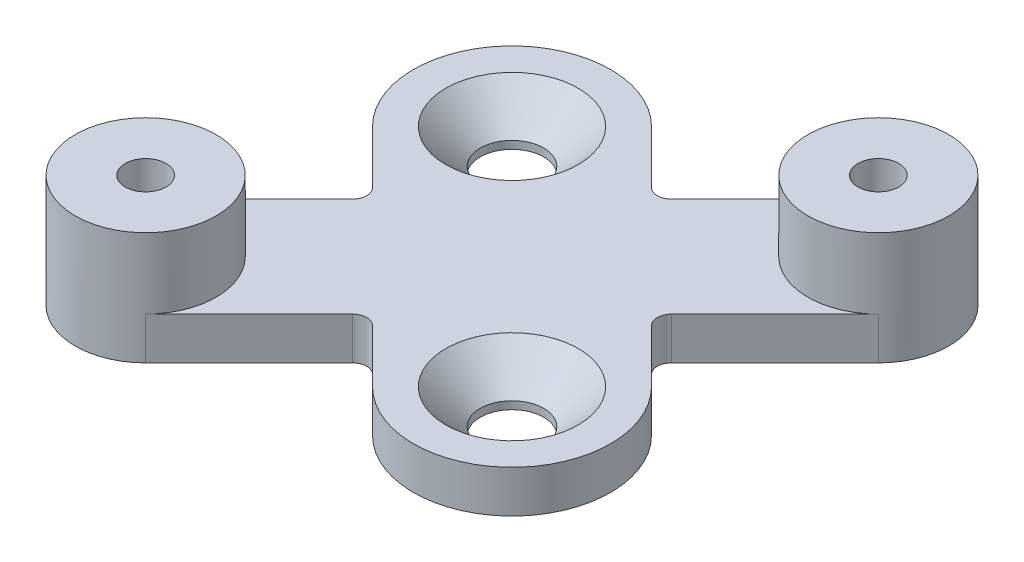
ISO-10303-21;
HEADER;
FILE_DESCRIPTION(('STEP AP214'),'2;1');
FILE_NAME('part.step','',(''),(''),'','','');
FILE_SCHEMA(('AUTOMOTIVE_DESIGN { 1 0 10303 214 1 1 1 1 }'));
ENDSEC;
DATA;
#1=APPLICATION_CONTEXT('core data for automotive mechanical design processes');
#2=APPLICATION_PROTOCOL_DEFINITION('international standard','automotive_design',2000,#1);
#3=PRODUCT_CONTEXT('',#1,'mechanical');
#4=PRODUCT('Part','Part','',(#3));
#5=PRODUCT_RELATED_PRODUCT_CATEGORY('part','',(#4));
#6=PRODUCT_DEFINITION_FORMATION('','',#4);
#7=PRODUCT_DEFINITION_CONTEXT('part definition',#1,'design');
#8=PRODUCT_DEFINITION('design','',#6,#7);
#9=PRODUCT_DEFINITION_SHAPE('','',#8);
#10=(LENGTH_UNIT() NAMED_UNIT(*) SI_UNIT(.MILLI.,.METRE.));
#11=(NAMED_UNIT(*) PLANE_ANGLE_UNIT() SI_UNIT($,.RADIAN.));
#12=(NAMED_UNIT(*) SI_UNIT($,.STERADIAN.) SOLID_ANGLE_UNIT());
#13=UNCERTAINTY_MEASURE_WITH_UNIT(LENGTH_MEASURE(1.E-05),#10,'distance_accuracy_value','');
#14=(GEOMETRIC_REPRESENTATION_CONTEXT(3) GLOBAL_UNCERTAINTY_ASSIGNED_CONTEXT((#13)) GLOBAL_UNIT_ASSIGNED_CONTEXT((#10,
#11,#12)) REPRESENTATION_CONTEXT('',''));
#15=CARTESIAN_POINT('',(0.,0.,0.));
#16=DIRECTION('',(0.,0.,1.));
#17=DIRECTION('',(1.,0.,0.));
#18=AXIS2_PLACEMENT_3D('',#15,#16,#17);
#19=CARTESIAN_POINT('',(13.0000000000001,3.,-13.));
#20=DIRECTION('',(0.,1.,0.));
#21=DIRECTION('',(0.,0.,1.));
#22=AXIS2_PLACEMENT_3D('',#19,#20,#21);
#23=PLANE('',#22);
#24=CARTESIAN_POINT('',(8.00000000000002,3.,8.00000000000003));
#25=DIRECTION('',(0.,1.,0.));
#26=DIRECTION('',(0.,0.,1.));
#27=AXIS2_PLACEMENT_3D('',#24,#25,#26);
#28=CIRCLE('',#27,4.7);
#29=CARTESIAN_POINT('',(8.00000000000002,3.,12.7));
#30=VERTEX_POINT('',#29);
#31=EDGE_CURVE('E242',#30,#30,#28,.T.);
#32=ORIENTED_EDGE('',*,*,#31,.F.);
#33=EDGE_LOOP('',(#32));
#34=FACE_BOUND('',#33,.T.);
#35=CARTESIAN_POINT('',(-7.99999999999998,3.,-8.00000000000003));
#36=DIRECTION('',(0.,1.,0.));
#37=DIRECTION('',(0.,0.,1.));
#38=AXIS2_PLACEMENT_3D('',#35,#36,#37);
#39=CIRCLE('',#38,4.7);
#40=CARTESIAN_POINT('',(-7.99999999999998,3.,-3.30000000000003));
#41=VERTEX_POINT('',#40);
#42=EDGE_CURVE('E233',#41,#41,#39,.T.);
#43=ORIENTED_EDGE('',*,*,#42,.F.);
#44=EDGE_LOOP('',(#43));
#45=FACE_BOUND('',#44,.T.);
#46=DIRECTION('',(0.707106781186551,0.,-0.707106781186544));
#47=VECTOR('',#46,1.);
#48=CARTESIAN_POINT('',(16.5355339059328,3.,-9.46446609406724));
#49=LINE('',#48,#47);
#50=CARTESIAN_POINT('',(9.19238815542514,3.,-2.12132034355963));
#51=VERTEX_POINT('',#50);
#52=CARTESIAN_POINT('',(16.5355339059328,3.,-9.46446609406724));
#53=VERTEX_POINT('',#52);
#54=EDGE_CURVE('E159',#51,#53,#49,.T.);
#55=ORIENTED_EDGE('',*,*,#54,.T.);
#56=CARTESIAN_POINT('',(13.0000000000001,3.,-13.));
#57=DIRECTION('',(0.,1.,0.));
#58=DIRECTION('',(0.,0.,1.));
#59=AXIS2_PLACEMENT_3D('',#56,#57,#58);
#60=CIRCLE('',#59,5.);
#61=CARTESIAN_POINT('',(9.46446609406734,3.,-16.5355339059327));
#62=VERTEX_POINT('',#61);
#63=EDGE_CURVE('E11',#53,#62,#60,.F.);
#64=ORIENTED_EDGE('',*,*,#63,.T.);
#65=DIRECTION('',(-0.707106781186551,0.,0.707106781186544));
#66=VECTOR('',#65,1.);
#67=CARTESIAN_POINT('',(1.41421356237312,3.,-8.48528137423857));
#68=LINE('',#67,#66);
#69=CARTESIAN_POINT('',(2.12132034355966,3.,-9.19238815542512));
#70=VERTEX_POINT('',#69);
#71=EDGE_CURVE('E252',#62,#70,#68,.T.);
#72=ORIENTED_EDGE('',*,*,#71,.T.);
#73=CARTESIAN_POINT('',(1.41421356237312,3.,-9.89949493661167));
#74=DIRECTION('',(0.,1.,0.));
#75=DIRECTION('',(0.,0.,1.));
#76=AXIS2_PLACEMENT_3D('',#73,#74,#75);
#77=CIRCLE('',#76,1.);
#78=CARTESIAN_POINT('',(0.707106781186574,3.,-9.19238815542512));
#79=VERTEX_POINT('',#78);
#80=EDGE_CURVE('E214',#70,#79,#77,.F.);
#81=ORIENTED_EDGE('',*,*,#80,.T.);
#82=DIRECTION('',(-0.707106781186546,0.,-0.707106781186549));
#83=VECTOR('',#82,1.);
#84=CARTESIAN_POINT('',(-3.05025253169415,3.,-12.9497474683058));
#85=LINE('',#84,#83);
#86=CARTESIAN_POINT('',(-3.05025253169415,3.,-12.9497474683058));
#87=VERTEX_POINT('',#86);
#88=EDGE_CURVE('E254',#79,#87,#85,.T.);
#89=ORIENTED_EDGE('',*,*,#88,.T.);
#90=CARTESIAN_POINT('',(-7.99999999999998,3.,-8.00000000000003));
#91=DIRECTION('',(0.,1.,0.));
#92=DIRECTION('',(0.,0.,1.));
#93=AXIS2_PLACEMENT_3D('',#90,#91,#92);
#94=CIRCLE('',#93,7.);
#95=CARTESIAN_POINT('',(-12.9497474683058,3.,-3.0502525316942));
#96=VERTEX_POINT('',#95);
#97=EDGE_CURVE('E256',#87,#96,#94,.T.);
#98=ORIENTED_EDGE('',*,*,#97,.T.);
#99=DIRECTION('',(0.707106781186546,0.,0.707106781186549));
#100=VECTOR('',#99,1.);
#101=CARTESIAN_POINT('',(-8.48528137423856,3.,1.41421356237307));
#102=LINE('',#101,#100);
#103=CARTESIAN_POINT('',(-9.19238815542511,3.,0.707106781186523));
#104=VERTEX_POINT('',#103);
#105=EDGE_CURVE('E258',#96,#104,#102,.T.);
#106=ORIENTED_EDGE('',*,*,#105,.T.);
#107=CARTESIAN_POINT('',(-9.89949493661166,3.,1.41421356237307));
#108=DIRECTION('',(0.,1.,0.));
#109=DIRECTION('',(0.,0.,1.));
#110=AXIS2_PLACEMENT_3D('',#107,#108,#109);
#111=CIRCLE('',#110,1.);
#112=CARTESIAN_POINT('',(-9.19238815542511,3.,2.12132034355962));
#113=VERTEX_POINT('',#112);
#114=EDGE_CURVE('E210',#104,#113,#111,.F.);
#115=ORIENTED_EDGE('',*,*,#114,.T.);
#116=DIRECTION('',(-0.707106781186549,0.,0.707106781186546));
#117=VECTOR('',#116,1.);
#118=CARTESIAN_POINT('',(-16.5355339059328,3.,9.46446609406725));
#119=LINE('',#118,#117);
#120=CARTESIAN_POINT('',(-16.5355339059328,3.,9.46446609406726));
#121=VERTEX_POINT('',#120);
#122=EDGE_CURVE('E261',#113,#121,#119,.T.);
#123=ORIENTED_EDGE('',*,*,#122,.T.);
#124=CARTESIAN_POINT('',(-13.,3.,13.));
#125=DIRECTION('',(0.,1.,0.));
#126=DIRECTION('',(0.,0.,1.));
#127=AXIS2_PLACEMENT_3D('',#124,#125,#126);
#128=CIRCLE('',#127,5.);
#129=CARTESIAN_POINT('',(-9.46446609406729,3.,16.5355339059327));
#130=VERTEX_POINT('',#129);
#131=EDGE_CURVE('E226',#130,#121,#128,.T.);
#132=ORIENTED_EDGE('',*,*,#131,.F.);
#133=DIRECTION('',(0.707106781186549,0.,-0.707106781186546));
#134=VECTOR('',#133,1.);
#135=CARTESIAN_POINT('',(-1.4142135623731,3.,8.48528137423856));
#136=LINE('',#135,#134);
#137=CARTESIAN_POINT('',(-2.12132034355964,3.,9.19238815542511));
#138=VERTEX_POINT('',#137);
#139=EDGE_CURVE('E223',#130,#138,#136,.T.);
#140=ORIENTED_EDGE('',*,*,#139,.T.);
#141=CARTESIAN_POINT('',(-1.4142135623731,3.,9.89949493661166));
#142=DIRECTION('',(0.,1.,0.));
#143=DIRECTION('',(0.,0.,1.));
#144=AXIS2_PLACEMENT_3D('',#141,#142,#143);
#145=CIRCLE('',#144,1.);
#146=CARTESIAN_POINT('',(-0.707106781186549,3.,9.19238815542511));
#147=VERTEX_POINT('',#146);
#148=EDGE_CURVE('E41',#138,#147,#145,.F.);
#149=ORIENTED_EDGE('',*,*,#148,.T.);
#150=DIRECTION('',(0.707106781186546,0.,0.707106781186549));
#151=VECTOR('',#150,1.);
#152=CARTESIAN_POINT('',(3.05025253169417,3.,12.9497474683058));
#153=LINE('',#152,#151);
#154=CARTESIAN_POINT('',(3.05025253169417,3.,12.9497474683058));
#155=VERTEX_POINT('',#154);
#156=EDGE_CURVE('E262',#147,#155,#153,.T.);
#157=ORIENTED_EDGE('',*,*,#156,.T.);
#158=CARTESIAN_POINT('',(8.00000000000002,3.,8.00000000000003));
#159=DIRECTION('',(0.,1.,0.));
#160=DIRECTION('',(0.,0.,1.));
#161=AXIS2_PLACEMENT_3D('',#158,#159,#160);
#162=CIRCLE('',#161,7.);
#163=CARTESIAN_POINT('',(12.9497474683059,3.,3.05025253169421));
#164=VERTEX_POINT('',#163);
#165=EDGE_CURVE('E264',#155,#164,#162,.T.);
#166=ORIENTED_EDGE('',*,*,#165,.T.);
#167=DIRECTION('',(-0.707106781186546,0.,-0.707106781186549));
#168=VECTOR('',#167,1.);
#169=CARTESIAN_POINT('',(8.48528137423858,3.,-1.41421356237309));
#170=LINE('',#169,#168);
#171=CARTESIAN_POINT('',(9.19238815542513,3.,-0.707106781186536));
#172=VERTEX_POINT('',#171);
#173=EDGE_CURVE('E166',#164,#172,#170,.T.);
#174=ORIENTED_EDGE('',*,*,#173,.T.);
#175=CARTESIAN_POINT('',(9.89949493661168,3.,-1.41421356237308));
#176=DIRECTION('',(0.,1.,0.));
#177=DIRECTION('',(0.,0.,1.));
#178=AXIS2_PLACEMENT_3D('',#175,#176,#177);
#179=CIRCLE('',#178,1.);
#180=EDGE_CURVE('E162',#172,#51,#179,.F.);
#181=ORIENTED_EDGE('',*,*,#180,.T.);
#182=EDGE_LOOP('',(#55,#64,#72,#81,#89,#98,#106,#115,#123,#132,#140,#149,#157,#166,#174,#181));
#183=FACE_BOUND('',#182,.T.);
#184=ADVANCED_FACE('F33',(#34,#45,#183),#23,.T.);
#185=CARTESIAN_POINT('',(13.0000000000001,3.,-13.));
#186=DIRECTION('',(0.,-1.,0.));
#187=DIRECTION('',(0.,0.,-1.));
#188=AXIS2_PLACEMENT_3D('',#185,#186,#187);
#189=CYLINDRICAL_SURFACE('',#188,5.);
#190=CARTESIAN_POINT('',(13.0000000000001,0.,-13.));
#191=DIRECTION('',(0.,1.,0.));
#192=DIRECTION('',(0.,0.,1.));
#193=AXIS2_PLACEMENT_3D('',#190,#191,#192);
#194=CIRCLE('',#193,5.);
#195=CARTESIAN_POINT('',(16.5355339059328,0.,-9.46446609406724));
#196=VERTEX_POINT('',#195);
#197=CARTESIAN_POINT('',(9.46446609406734,0.,-16.5355339059327));
#198=VERTEX_POINT('',#197);
#199=EDGE_CURVE('E251',#196,#198,#194,.T.);
#200=ORIENTED_EDGE('',*,*,#199,.T.);
#201=DIRECTION('',(0.,-1.,0.));
#202=VECTOR('',#201,1.);
#203=CARTESIAN_POINT('',(9.46446609406734,3.,-16.5355339059327));
#204=LINE('',#203,#202);
#205=EDGE_CURVE('E154',#62,#198,#204,.T.);
#206=ORIENTED_EDGE('',*,*,#205,.F.);
#207=ORIENTED_EDGE('',*,*,#63,.F.);
#208=DIRECTION('',(0.,-1.,0.));
#209=VECTOR('',#208,1.);
#210=CARTESIAN_POINT('',(16.5355339059328,3.,-9.46446609406724));
#211=LINE('',#210,#209);
#212=EDGE_CURVE('E151',#53,#196,#211,.T.);
#213=ORIENTED_EDGE('',*,*,#212,.T.);
#214=EDGE_LOOP('',(#200,#206,#207,#213));
#215=FACE_BOUND('',#214,.T.);
#216=CARTESIAN_POINT('',(13.0000000000001,8.,-13.));
#217=DIRECTION('',(0.,1.,0.));
#218=DIRECTION('',(0.,0.,1.));
#219=AXIS2_PLACEMENT_3D('',#216,#217,#218);
#220=CIRCLE('',#219,5.);
#221=CARTESIAN_POINT('',(13.0000000000001,8.,-7.99999999999999));
#222=VERTEX_POINT('',#221);
#223=EDGE_CURVE('E231',#222,#222,#220,.T.);
#224=ORIENTED_EDGE('',*,*,#223,.F.);
#225=EDGE_LOOP('',(#224));
#226=FACE_BOUND('',#225,.T.);
#227=ADVANCED_FACE('F148',(#215,#226),#189,.T.);
#228=CARTESIAN_POINT('',(1.41421356237312,3.,-8.48528137423857));
#229=DIRECTION('',(0.707106781186544,0.,0.70710678118655));
#230=DIRECTION('',(0.707106781186551,0.,-0.707106781186545));
#231=AXIS2_PLACEMENT_3D('',#228,#229,#230);
#232=PLANE('',#231);
#233=DIRECTION('',(-0.707106781186551,0.,0.707106781186544));
#234=VECTOR('',#233,1.);
#235=CARTESIAN_POINT('',(1.41421356237312,0.,-8.48528137423857));
#236=LINE('',#235,#234);
#237=CARTESIAN_POINT('',(2.12132034355966,0.,-9.19238815542512));
#238=VERTEX_POINT('',#237);
#239=EDGE_CURVE('E268',#198,#238,#236,.T.);
#240=ORIENTED_EDGE('',*,*,#239,.T.);
#241=DIRECTION('',(0.,-1.,0.));
#242=VECTOR('',#241,1.);
#243=CARTESIAN_POINT('',(2.12132034355966,3.,-9.19238815542512));
#244=LINE('',#243,#242);
#245=EDGE_CURVE('E198',#238,#70,#244,.F.);
#246=ORIENTED_EDGE('',*,*,#245,.T.);
#247=ORIENTED_EDGE('',*,*,#71,.F.);
#248=ORIENTED_EDGE('',*,*,#205,.T.);
#249=EDGE_LOOP('',(#240,#246,#247,#248));
#250=FACE_BOUND('',#249,.T.);
#251=ADVANCED_FACE('F302',(#250),#232,.F.);
#252=CARTESIAN_POINT('',(-3.05025253169415,3.,-12.9497474683058));
#253=DIRECTION('',(-0.707106781186549,0.,0.707106781186546));
#254=DIRECTION('',(0.707106781186546,0.,0.707106781186549));
#255=AXIS2_PLACEMENT_3D('',#252,#253,#254);
#256=PLANE('',#255);
#257=ORIENTED_EDGE('',*,*,#88,.F.);
#258=DIRECTION('',(0.,-1.,0.));
#259=VECTOR('',#258,1.);
#260=CARTESIAN_POINT('',(0.707106781186573,0.,-9.19238815542512));
#261=LINE('',#260,#259);
#262=CARTESIAN_POINT('',(0.707106781186574,0.,-9.19238815542512));
#263=VERTEX_POINT('',#262);
#264=EDGE_CURVE('E195',#79,#263,#261,.T.);
#265=ORIENTED_EDGE('',*,*,#264,.T.);
#266=DIRECTION('',(-0.707106781186546,0.,-0.707106781186549));
#267=VECTOR('',#266,1.);
#268=CARTESIAN_POINT('',(-3.05025253169415,0.,-12.9497474683058));
#269=LINE('',#268,#267);
#270=CARTESIAN_POINT('',(-3.05025253169415,0.,-12.9497474683058));
#271=VERTEX_POINT('',#270);
#272=EDGE_CURVE('E271',#263,#271,#269,.T.);
#273=ORIENTED_EDGE('',*,*,#272,.T.);
#274=DIRECTION('',(0.,-1.,0.));
#275=VECTOR('',#274,1.);
#276=CARTESIAN_POINT('',(-3.05025253169415,3.,-12.9497474683058));
#277=LINE('',#276,#275);
#278=EDGE_CURVE('E185',#87,#271,#277,.T.);
#279=ORIENTED_EDGE('',*,*,#278,.F.);
#280=EDGE_LOOP('',(#257,#265,#273,#279));
#281=FACE_BOUND('',#280,.T.);
#282=ADVANCED_FACE('F309',(#281),#256,.F.);
#283=CARTESIAN_POINT('',(-7.99999999999998,3.,-8.00000000000003));
#284=DIRECTION('',(0.,-1.,0.));
#285=DIRECTION('',(0.,0.,-1.));
#286=AXIS2_PLACEMENT_3D('',#283,#284,#285);
#287=CYLINDRICAL_SURFACE('',#286,7.);
#288=CARTESIAN_POINT('',(-7.99999999999998,0.,-8.00000000000003));
#289=DIRECTION('',(0.,1.,0.));
#290=DIRECTION('',(0.,0.,1.));
#291=AXIS2_PLACEMENT_3D('',#288,#289,#290);
#292=CIRCLE('',#291,7.);
#293=CARTESIAN_POINT('',(-12.9497474683058,0.,-3.0502525316942));
#294=VERTEX_POINT('',#293);
#295=EDGE_CURVE('E273',#271,#294,#292,.T.);
#296=ORIENTED_EDGE('',*,*,#295,.T.);
#297=DIRECTION('',(0.,-1.,0.));
#298=VECTOR('',#297,1.);
#299=CARTESIAN_POINT('',(-12.9497474683058,3.,-3.0502525316942));
#300=LINE('',#299,#298);
#301=EDGE_CURVE('E182',#96,#294,#300,.T.);
#302=ORIENTED_EDGE('',*,*,#301,.F.);
#303=ORIENTED_EDGE('',*,*,#97,.F.);
#304=ORIENTED_EDGE('',*,*,#278,.T.);
#305=EDGE_LOOP('',(#296,#302,#303,#304));
#306=FACE_BOUND('',#305,.T.);
#307=ADVANCED_FACE('F315',(#306),#287,.T.);
#308=CARTESIAN_POINT('',(-8.48528137423856,3.,1.41421356237307));
#309=DIRECTION('',(0.707106781186549,0.,-0.707106781186546));
#310=DIRECTION('',(-0.707106781186546,0.,-0.707106781186549));
#311=AXIS2_PLACEMENT_3D('',#308,#309,#310);
#312=PLANE('',#311);
#313=DIRECTION('',(0.707106781186546,0.,0.707106781186549));
#314=VECTOR('',#313,1.);
#315=CARTESIAN_POINT('',(-8.48528137423856,0.,1.41421356237307));
#316=LINE('',#315,#314);
#317=CARTESIAN_POINT('',(-9.19238815542511,0.,0.707106781186523));
#318=VERTEX_POINT('',#317);
#319=EDGE_CURVE('E275',#294,#318,#316,.T.);
#320=ORIENTED_EDGE('',*,*,#319,.T.);
#321=DIRECTION('',(0.,-1.,0.));
#322=VECTOR('',#321,1.);
#323=CARTESIAN_POINT('',(-9.19238815542511,3.,0.707106781186523));
#324=LINE('',#323,#322);
#325=EDGE_CURVE('E193',#318,#104,#324,.F.);
#326=ORIENTED_EDGE('',*,*,#325,.T.);
#327=ORIENTED_EDGE('',*,*,#105,.F.);
#328=ORIENTED_EDGE('',*,*,#301,.T.);
#329=EDGE_LOOP('',(#320,#326,#327,#328));
#330=FACE_BOUND('',#329,.T.);
#331=ADVANCED_FACE('F319',(#330),#312,.F.);
#332=CARTESIAN_POINT('',(-16.5355339059328,3.,9.46446609406725));
#333=DIRECTION('',(0.707106781186546,0.,0.707106781186548));
#334=DIRECTION('',(0.707106781186549,0.,-0.707106781186546));
#335=AXIS2_PLACEMENT_3D('',#332,#333,#334);
#336=PLANE('',#335);
#337=ORIENTED_EDGE('',*,*,#122,.F.);
#338=DIRECTION('',(0.,-1.,0.));
#339=VECTOR('',#338,1.);
#340=CARTESIAN_POINT('',(-9.19238815542511,0.,2.12132034355962));
#341=LINE('',#340,#339);
#342=CARTESIAN_POINT('',(-9.19238815542511,0.,2.12132034355962));
#343=VERTEX_POINT('',#342);
#344=EDGE_CURVE('E190',#113,#343,#341,.T.);
#345=ORIENTED_EDGE('',*,*,#344,.T.);
#346=DIRECTION('',(-0.707106781186549,0.,0.707106781186546));
#347=VECTOR('',#346,1.);
#348=CARTESIAN_POINT('',(-16.5355339059328,0.,9.46446609406725));
#349=LINE('',#348,#347);
#350=CARTESIAN_POINT('',(-16.5355339059328,0.,9.46446609406726));
#351=VERTEX_POINT('',#350);
#352=EDGE_CURVE('E278',#343,#351,#349,.T.);
#353=ORIENTED_EDGE('',*,*,#352,.T.);
#354=DIRECTION('',(0.,-1.,0.));
#355=VECTOR('',#354,1.);
#356=CARTESIAN_POINT('',(-16.5355339059328,3.,9.46446609406726));
#357=LINE('',#356,#355);
#358=EDGE_CURVE('E186',#121,#351,#357,.T.);
#359=ORIENTED_EDGE('',*,*,#358,.F.);
#360=EDGE_LOOP('',(#337,#345,#353,#359));
#361=FACE_BOUND('',#360,.T.);
#362=ADVANCED_FACE('F328',(#361),#336,.F.);
#363=CARTESIAN_POINT('',(-13.,3.,13.));
#364=DIRECTION('',(0.,-1.,0.));
#365=DIRECTION('',(0.,0.,-1.));
#366=AXIS2_PLACEMENT_3D('',#363,#364,#365);
#367=CYLINDRICAL_SURFACE('',#366,5.);
#368=CARTESIAN_POINT('',(-13.,0.,13.));
#369=DIRECTION('',(0.,1.,0.));
#370=DIRECTION('',(0.,0.,1.));
#371=AXIS2_PLACEMENT_3D('',#368,#369,#370);
#372=CIRCLE('',#371,5.);
#373=CARTESIAN_POINT('',(-9.4644660940673,0.,16.5355339059327));
#374=VERTEX_POINT('',#373);
#375=EDGE_CURVE('E280',#351,#374,#372,.T.);
#376=ORIENTED_EDGE('',*,*,#375,.T.);
#377=DIRECTION('',(0.,-1.,0.));
#378=VECTOR('',#377,1.);
#379=CARTESIAN_POINT('',(-9.4644660940673,3.,16.5355339059327));
#380=LINE('',#379,#378);
#381=EDGE_CURVE('E181',#130,#374,#380,.T.);
#382=ORIENTED_EDGE('',*,*,#381,.F.);
#383=ORIENTED_EDGE('',*,*,#131,.T.);
#384=ORIENTED_EDGE('',*,*,#358,.T.);
#385=EDGE_LOOP('',(#376,#382,#383,#384));
#386=FACE_BOUND('',#385,.T.);
#387=CARTESIAN_POINT('',(-13.,8.,13.));
#388=DIRECTION('',(0.,1.,0.));
#389=DIRECTION('',(0.,0.,1.));
#390=AXIS2_PLACEMENT_3D('',#387,#388,#389);
#391=CIRCLE('',#390,5.);
#392=CARTESIAN_POINT('',(-13.,8.,18.));
#393=VERTEX_POINT('',#392);
#394=EDGE_CURVE('E230',#393,#393,#391,.T.);
#395=ORIENTED_EDGE('',*,*,#394,.F.);
#396=EDGE_LOOP('',(#395));
#397=FACE_BOUND('',#396,.T.);
#398=ADVANCED_FACE('F335',(#386,#397),#367,.T.);
#399=CARTESIAN_POINT('',(-1.4142135623731,3.,8.48528137423856));
#400=DIRECTION('',(-0.707106781186546,0.,-0.707106781186549));
#401=DIRECTION('',(-0.707106781186549,0.,0.707106781186546));
#402=AXIS2_PLACEMENT_3D('',#399,#400,#401);
#403=PLANE('',#402);
#404=DIRECTION('',(0.707106781186549,0.,-0.707106781186546));
#405=VECTOR('',#404,1.);
#406=CARTESIAN_POINT('',(-1.4142135623731,0.,8.48528137423856));
#407=LINE('',#406,#405);
#408=CARTESIAN_POINT('',(-2.12132034355964,0.,9.19238815542511));
#409=VERTEX_POINT('',#408);
#410=EDGE_CURVE('E282',#374,#409,#407,.T.);
#411=ORIENTED_EDGE('',*,*,#410,.T.);
#412=DIRECTION('',(0.,-1.,0.));
#413=VECTOR('',#412,1.);
#414=CARTESIAN_POINT('',(-2.12132034355964,3.,9.19238815542511));
#415=LINE('',#414,#413);
#416=EDGE_CURVE('E48',#409,#138,#415,.F.);
#417=ORIENTED_EDGE('',*,*,#416,.T.);
#418=ORIENTED_EDGE('',*,*,#139,.F.);
#419=ORIENTED_EDGE('',*,*,#381,.T.);
#420=EDGE_LOOP('',(#411,#417,#418,#419));
#421=FACE_BOUND('',#420,.T.);
#422=ADVANCED_FACE('F338',(#421),#403,.F.);
#423=CARTESIAN_POINT('',(3.05025253169417,3.,12.9497474683058));
#424=DIRECTION('',(0.707106781186549,0.,-0.707106781186546));
#425=DIRECTION('',(-0.707106781186546,0.,-0.707106781186549));
#426=AXIS2_PLACEMENT_3D('',#423,#424,#425);
#427=PLANE('',#426);
#428=ORIENTED_EDGE('',*,*,#156,.F.);
#429=DIRECTION('',(0.,-1.,0.));
#430=VECTOR('',#429,1.);
#431=CARTESIAN_POINT('',(-0.707106781186549,0.,9.19238815542511));
#432=LINE('',#431,#430);
#433=CARTESIAN_POINT('',(-0.707106781186549,0.,9.19238815542511));
#434=VERTEX_POINT('',#433);
#435=EDGE_CURVE('E204',#147,#434,#432,.T.);
#436=ORIENTED_EDGE('',*,*,#435,.T.);
#437=DIRECTION('',(0.707106781186546,0.,0.707106781186549));
#438=VECTOR('',#437,1.);
#439=CARTESIAN_POINT('',(3.05025253169417,0.,12.9497474683058));
#440=LINE('',#439,#438);
#441=CARTESIAN_POINT('',(3.05025253169417,0.,12.9497474683058));
#442=VERTEX_POINT('',#441);
#443=EDGE_CURVE('E284',#434,#442,#440,.T.);
#444=ORIENTED_EDGE('',*,*,#443,.T.);
#445=DIRECTION('',(0.,-1.,0.));
#446=VECTOR('',#445,1.);
#447=CARTESIAN_POINT('',(3.05025253169417,3.,12.9497474683058));
#448=LINE('',#447,#446);
#449=EDGE_CURVE('E174',#155,#442,#448,.T.);
#450=ORIENTED_EDGE('',*,*,#449,.F.);
#451=EDGE_LOOP('',(#428,#436,#444,#450));
#452=FACE_BOUND('',#451,.T.);
#453=ADVANCED_FACE('F353',(#452),#427,.F.);
#454=CARTESIAN_POINT('',(8.00000000000002,3.,8.00000000000003));
#455=DIRECTION('',(0.,-1.,0.));
#456=DIRECTION('',(0.,0.,-1.));
#457=AXIS2_PLACEMENT_3D('',#454,#455,#456);
#458=CYLINDRICAL_SURFACE('',#457,7.);
#459=CARTESIAN_POINT('',(8.00000000000002,0.,8.00000000000003));
#460=DIRECTION('',(0.,1.,0.));
#461=DIRECTION('',(0.,0.,1.));
#462=AXIS2_PLACEMENT_3D('',#459,#460,#461);
#463=CIRCLE('',#462,7.);
#464=CARTESIAN_POINT('',(12.9497474683059,0.,3.05025253169421));
#465=VERTEX_POINT('',#464);
#466=EDGE_CURVE('E286',#442,#465,#463,.T.);
#467=ORIENTED_EDGE('',*,*,#466,.T.);
#468=DIRECTION('',(0.,-1.,0.));
#469=VECTOR('',#468,1.);
#470=CARTESIAN_POINT('',(12.9497474683059,3.,3.05025253169421));
#471=LINE('',#470,#469);
#472=EDGE_CURVE('E171',#164,#465,#471,.T.);
#473=ORIENTED_EDGE('',*,*,#472,.F.);
#474=ORIENTED_EDGE('',*,*,#165,.F.);
#475=ORIENTED_EDGE('',*,*,#449,.T.);
#476=EDGE_LOOP('',(#467,#473,#474,#475));
#477=FACE_BOUND('',#476,.T.);
#478=ADVANCED_FACE('F356',(#477),#458,.T.);
#479=CARTESIAN_POINT('',(8.48528137423858,3.,-1.41421356237309));
#480=DIRECTION('',(-0.707106781186549,0.,0.707106781186546));
#481=DIRECTION('',(0.707106781186546,0.,0.707106781186549));
#482=AXIS2_PLACEMENT_3D('',#479,#480,#481);
#483=PLANE('',#482);
#484=DIRECTION('',(-0.707106781186546,0.,-0.707106781186549));
#485=VECTOR('',#484,1.);
#486=CARTESIAN_POINT('',(8.48528137423858,0.,-1.41421356237309));
#487=LINE('',#486,#485);
#488=CARTESIAN_POINT('',(9.19238815542513,0.,-0.707106781186536));
#489=VERTEX_POINT('',#488);
#490=EDGE_CURVE('E287',#465,#489,#487,.T.);
#491=ORIENTED_EDGE('',*,*,#490,.T.);
#492=DIRECTION('',(0.,-1.,0.));
#493=VECTOR('',#492,1.);
#494=CARTESIAN_POINT('',(9.19238815542513,3.,-0.707106781186536));
#495=LINE('',#494,#493);
#496=EDGE_CURVE('E202',#489,#172,#495,.F.);
#497=ORIENTED_EDGE('',*,*,#496,.T.);
#498=ORIENTED_EDGE('',*,*,#173,.F.);
#499=ORIENTED_EDGE('',*,*,#472,.T.);
#500=EDGE_LOOP('',(#491,#497,#498,#499));
#501=FACE_BOUND('',#500,.T.);
#502=ADVANCED_FACE('F292',(#501),#483,.F.);
#503=CARTESIAN_POINT('',(16.5355339059328,3.,-9.46446609406724));
#504=DIRECTION('',(-0.707106781186544,0.,-0.707106781186551));
#505=DIRECTION('',(-0.707106781186551,0.,0.707106781186544));
#506=AXIS2_PLACEMENT_3D('',#503,#504,#505);
#507=PLANE('',#506);
#508=ORIENTED_EDGE('',*,*,#54,.F.);
#509=DIRECTION('',(0.,-1.,0.));
#510=VECTOR('',#509,1.);
#511=CARTESIAN_POINT('',(9.19238815542514,0.,-2.12132034355963));
#512=LINE('',#511,#510);
#513=CARTESIAN_POINT('',(9.19238815542514,0.,-2.12132034355963));
#514=VERTEX_POINT('',#513);
#515=EDGE_CURVE('E200',#51,#514,#512,.T.);
#516=ORIENTED_EDGE('',*,*,#515,.T.);
#517=DIRECTION('',(0.707106781186551,0.,-0.707106781186544));
#518=VECTOR('',#517,1.);
#519=CARTESIAN_POINT('',(16.5355339059328,0.,-9.46446609406724));
#520=LINE('',#519,#518);
#521=EDGE_CURVE('E170',#514,#196,#520,.T.);
#522=ORIENTED_EDGE('',*,*,#521,.T.);
#523=ORIENTED_EDGE('',*,*,#212,.F.);
#524=EDGE_LOOP('',(#508,#516,#522,#523));
#525=FACE_BOUND('',#524,.T.);
#526=ADVANCED_FACE('F168',(#525),#507,.F.);
#527=CARTESIAN_POINT('',(13.0000000000001,0.,-13.));
#528=DIRECTION('',(0.,1.,0.));
#529=DIRECTION('',(0.,0.,1.));
#530=AXIS2_PLACEMENT_3D('',#527,#528,#529);
#531=PLANE('',#530);
#532=CARTESIAN_POINT('',(13.0000000000001,0.,-13.));
#533=DIRECTION('',(0.,1.,0.));
#534=DIRECTION('',(0.,0.,1.));
#535=AXIS2_PLACEMENT_3D('',#532,#533,#534);
#536=CIRCLE('',#535,1.45);
#537=CARTESIAN_POINT('',(13.0000000000001,0.,-11.55));
#538=VERTEX_POINT('',#537);
#539=EDGE_CURVE('E602',#538,#538,#536,.T.);
#540=ORIENTED_EDGE('',*,*,#539,.T.);
#541=EDGE_LOOP('',(#540));
#542=FACE_BOUND('',#541,.T.);
#543=CARTESIAN_POINT('',(-13.,0.,13.));
#544=DIRECTION('',(0.,1.,0.));
#545=DIRECTION('',(0.,0.,1.));
#546=AXIS2_PLACEMENT_3D('',#543,#544,#545);
#547=CIRCLE('',#546,1.45);
#548=CARTESIAN_POINT('',(-13.,0.,14.45));
#549=VERTEX_POINT('',#548);
#550=EDGE_CURVE('E606',#549,#549,#547,.T.);
#551=ORIENTED_EDGE('',*,*,#550,.T.);
#552=EDGE_LOOP('',(#551));
#553=FACE_BOUND('',#552,.T.);
#554=CARTESIAN_POINT('',(-7.99999999999998,0.,-8.00000000000003));
#555=DIRECTION('',(0.,1.,0.));
#556=DIRECTION('',(0.,0.,1.));
#557=AXIS2_PLACEMENT_3D('',#554,#555,#556);
#558=CIRCLE('',#557,2.24999999999999);
#559=CARTESIAN_POINT('',(-7.99999999999998,0.,-5.75000000000004));
#560=VERTEX_POINT('',#559);
#561=EDGE_CURVE('E239',#560,#560,#558,.T.);
#562=ORIENTED_EDGE('',*,*,#561,.T.);
#563=EDGE_LOOP('',(#562));
#564=FACE_BOUND('',#563,.T.);
#565=CARTESIAN_POINT('',(8.00000000000002,0.,8.00000000000003));
#566=DIRECTION('',(0.,1.,0.));
#567=DIRECTION('',(0.,0.,1.));
#568=AXIS2_PLACEMENT_3D('',#565,#566,#567);
#569=CIRCLE('',#568,2.24999999999999);
#570=CARTESIAN_POINT('',(8.00000000000002,0.,10.25));
#571=VERTEX_POINT('',#570);
#572=EDGE_CURVE('E248',#571,#571,#569,.T.);
#573=ORIENTED_EDGE('',*,*,#572,.T.);
#574=EDGE_LOOP('',(#573));
#575=FACE_BOUND('',#574,.T.);
#576=ORIENTED_EDGE('',*,*,#199,.F.);
#577=ORIENTED_EDGE('',*,*,#521,.F.);
#578=CARTESIAN_POINT('',(9.89949493661168,0.,-1.41421356237308));
#579=DIRECTION('',(0.,1.,0.));
#580=DIRECTION('',(0.,0.,1.));
#581=AXIS2_PLACEMENT_3D('',#578,#579,#580);
#582=CIRCLE('',#581,1.);
#583=EDGE_CURVE('E216',#514,#489,#582,.T.);
#584=ORIENTED_EDGE('',*,*,#583,.T.);
#585=ORIENTED_EDGE('',*,*,#490,.F.);
#586=ORIENTED_EDGE('',*,*,#466,.F.);
#587=ORIENTED_EDGE('',*,*,#443,.F.);
#588=CARTESIAN_POINT('',(-1.4142135623731,0.,9.89949493661166));
#589=DIRECTION('',(0.,1.,0.));
#590=DIRECTION('',(0.,0.,1.));
#591=AXIS2_PLACEMENT_3D('',#588,#589,#590);
#592=CIRCLE('',#591,1.);
#593=EDGE_CURVE('E56',#434,#409,#592,.T.);
#594=ORIENTED_EDGE('',*,*,#593,.T.);
#595=ORIENTED_EDGE('',*,*,#410,.F.);
#596=ORIENTED_EDGE('',*,*,#375,.F.);
#597=ORIENTED_EDGE('',*,*,#352,.F.);
#598=CARTESIAN_POINT('',(-9.89949493661166,0.,1.41421356237307));
#599=DIRECTION('',(0.,1.,0.));
#600=DIRECTION('',(0.,0.,1.));
#601=AXIS2_PLACEMENT_3D('',#598,#599,#600);
#602=CIRCLE('',#601,1.);
#603=EDGE_CURVE('E208',#343,#318,#602,.T.);
#604=ORIENTED_EDGE('',*,*,#603,.T.);
#605=ORIENTED_EDGE('',*,*,#319,.F.);
#606=ORIENTED_EDGE('',*,*,#295,.F.);
#607=ORIENTED_EDGE('',*,*,#272,.F.);
#608=CARTESIAN_POINT('',(1.41421356237312,0.,-9.89949493661167));
#609=DIRECTION('',(0.,1.,0.));
#610=DIRECTION('',(0.,0.,1.));
#611=AXIS2_PLACEMENT_3D('',#608,#609,#610);
#612=CIRCLE('',#611,1.);
#613=EDGE_CURVE('E212',#263,#238,#612,.T.);
#614=ORIENTED_EDGE('',*,*,#613,.T.);
#615=ORIENTED_EDGE('',*,*,#239,.F.);
#616=EDGE_LOOP('',(#576,#577,#584,#585,#586,#587,#594,#595,#596,#597,#604,#605,#606,#607,#614,#615));
#617=FACE_BOUND('',#616,.T.);
#618=ADVANCED_FACE('F298',(#542,#553,#564,#575,#617),#531,.F.);
#619=CARTESIAN_POINT('',(-9.89949493661166,3.,1.41421356237307));
#620=DIRECTION('',(0.,1.,0.));
#621=DIRECTION('',(0.,0.,1.));
#622=AXIS2_PLACEMENT_3D('',#619,#620,#621);
#623=CYLINDRICAL_SURFACE('',#622,1.);
#624=ORIENTED_EDGE('',*,*,#114,.F.);
#625=ORIENTED_EDGE('',*,*,#325,.F.);
#626=ORIENTED_EDGE('',*,*,#603,.F.);
#627=ORIENTED_EDGE('',*,*,#344,.F.);
#628=EDGE_LOOP('',(#624,#625,#626,#627));
#629=FACE_BOUND('',#628,.T.);
#630=ADVANCED_FACE('F325',(#629),#623,.F.);
#631=CARTESIAN_POINT('',(1.41421356237312,3.,-9.89949493661167));
#632=DIRECTION('',(0.,1.,0.));
#633=DIRECTION('',(0.,0.,1.));
#634=AXIS2_PLACEMENT_3D('',#631,#632,#633);
#635=CYLINDRICAL_SURFACE('',#634,1.);
#636=ORIENTED_EDGE('',*,*,#80,.F.);
#637=ORIENTED_EDGE('',*,*,#245,.F.);
#638=ORIENTED_EDGE('',*,*,#613,.F.);
#639=ORIENTED_EDGE('',*,*,#264,.F.);
#640=EDGE_LOOP('',(#636,#637,#638,#639));
#641=FACE_BOUND('',#640,.T.);
#642=ADVANCED_FACE('F307',(#641),#635,.F.);
#643=CARTESIAN_POINT('',(9.89949493661168,3.,-1.41421356237308));
#644=DIRECTION('',(0.,1.,0.));
#645=DIRECTION('',(0.,0.,1.));
#646=AXIS2_PLACEMENT_3D('',#643,#644,#645);
#647=CYLINDRICAL_SURFACE('',#646,1.);
#648=ORIENTED_EDGE('',*,*,#180,.F.);
#649=ORIENTED_EDGE('',*,*,#496,.F.);
#650=ORIENTED_EDGE('',*,*,#583,.F.);
#651=ORIENTED_EDGE('',*,*,#515,.F.);
#652=EDGE_LOOP('',(#648,#649,#650,#651));
#653=FACE_BOUND('',#652,.T.);
#654=ADVANCED_FACE('F297',(#653),#647,.F.);
#655=CARTESIAN_POINT('',(-1.4142135623731,3.,9.89949493661166));
#656=DIRECTION('',(0.,1.,0.));
#657=DIRECTION('',(0.,0.,1.));
#658=AXIS2_PLACEMENT_3D('',#655,#656,#657);
#659=CYLINDRICAL_SURFACE('',#658,1.);
#660=ORIENTED_EDGE('',*,*,#148,.F.);
#661=ORIENTED_EDGE('',*,*,#416,.F.);
#662=ORIENTED_EDGE('',*,*,#593,.F.);
#663=ORIENTED_EDGE('',*,*,#435,.F.);
#664=EDGE_LOOP('',(#660,#661,#662,#663));
#665=FACE_BOUND('',#664,.T.);
#666=ADVANCED_FACE('F35',(#665),#659,.F.);
#667=CARTESIAN_POINT('',(8.00000000000002,3.,8.00000000000003));
#668=DIRECTION('',(0.,1.,0.));
#669=DIRECTION('',(0.,0.,1.));
#670=AXIS2_PLACEMENT_3D('',#667,#668,#669);
#671=CYLINDRICAL_SURFACE('',#670,2.24999999999999);
#672=ORIENTED_EDGE('',*,*,#572,.F.);
#673=EDGE_LOOP('',(#672));
#674=FACE_BOUND('',#673,.T.);
#675=CARTESIAN_POINT('',(8.00000000000002,0.55,8.00000000000003));
#676=DIRECTION('',(0.,1.,0.));
#677=DIRECTION('',(0.,0.,1.));
#678=AXIS2_PLACEMENT_3D('',#675,#676,#677);
#679=CIRCLE('',#678,2.25);
#680=CARTESIAN_POINT('',(8.00000000000002,0.55,10.25));
#681=VERTEX_POINT('',#680);
#682=EDGE_CURVE('E245',#681,#681,#679,.T.);
#683=ORIENTED_EDGE('',*,*,#682,.T.);
#684=EDGE_LOOP('',(#683));
#685=FACE_BOUND('',#684,.T.);
#686=ADVANCED_FACE('F377',(#674,#685),#671,.F.);
#687=CARTESIAN_POINT('',(8.00000000000002,3.,8.00000000000003));
#688=DIRECTION('',(0.,1.,0.));
#689=DIRECTION('',(0.,0.,1.));
#690=AXIS2_PLACEMENT_3D('',#687,#688,#689);
#691=CONICAL_SURFACE('',#690,4.7,0.785398163397448);
#692=ORIENTED_EDGE('',*,*,#682,.F.);
#693=EDGE_LOOP('',(#692));
#694=FACE_BOUND('',#693,.T.);
#695=ORIENTED_EDGE('',*,*,#31,.T.);
#696=EDGE_LOOP('',(#695));
#697=FACE_BOUND('',#696,.T.);
#698=ADVANCED_FACE('F421',(#694,#697),#691,.F.);
#699=CARTESIAN_POINT('',(-7.99999999999998,3.,-8.00000000000003));
#700=DIRECTION('',(0.,1.,0.));
#701=DIRECTION('',(0.,0.,1.));
#702=AXIS2_PLACEMENT_3D('',#699,#700,#701);
#703=CYLINDRICAL_SURFACE('',#702,2.24999999999999);
#704=ORIENTED_EDGE('',*,*,#561,.F.);
#705=EDGE_LOOP('',(#704));
#706=FACE_BOUND('',#705,.T.);
#707=CARTESIAN_POINT('',(-7.99999999999998,0.55,-8.00000000000003));
#708=DIRECTION('',(0.,1.,0.));
#709=DIRECTION('',(0.,0.,1.));
#710=AXIS2_PLACEMENT_3D('',#707,#708,#709);
#711=CIRCLE('',#710,2.25);
#712=CARTESIAN_POINT('',(-7.99999999999998,0.55,-5.75000000000003));
#713=VERTEX_POINT('',#712);
#714=EDGE_CURVE('E236',#713,#713,#711,.T.);
#715=ORIENTED_EDGE('',*,*,#714,.T.);
#716=EDGE_LOOP('',(#715));
#717=FACE_BOUND('',#716,.T.);
#718=ADVANCED_FACE('F428',(#706,#717),#703,.F.);
#719=CARTESIAN_POINT('',(-7.99999999999998,3.,-8.00000000000003));
#720=DIRECTION('',(0.,1.,0.));
#721=DIRECTION('',(0.,0.,1.));
#722=AXIS2_PLACEMENT_3D('',#719,#720,#721);
#723=CONICAL_SURFACE('',#722,4.7,0.785398163397448);
#724=ORIENTED_EDGE('',*,*,#714,.F.);
#725=EDGE_LOOP('',(#724));
#726=FACE_BOUND('',#725,.T.);
#727=ORIENTED_EDGE('',*,*,#42,.T.);
#728=EDGE_LOOP('',(#727));
#729=FACE_BOUND('',#728,.T.);
#730=ADVANCED_FACE('F435',(#726,#729),#723,.F.);
#731=CARTESIAN_POINT('',(-13.,8.,13.));
#732=DIRECTION('',(0.,1.,0.));
#733=DIRECTION('',(0.,0.,1.));
#734=AXIS2_PLACEMENT_3D('',#731,#732,#733);
#735=PLANE('',#734);
#736=CARTESIAN_POINT('',(-13.,8.,13.));
#737=DIRECTION('',(0.,1.,0.));
#738=DIRECTION('',(0.,0.,1.));
#739=AXIS2_PLACEMENT_3D('',#736,#737,#738);
#740=CIRCLE('',#739,1.45);
#741=CARTESIAN_POINT('',(-13.,8.,14.45));
#742=VERTEX_POINT('',#741);
#743=EDGE_CURVE('E603',#742,#742,#740,.T.);
#744=ORIENTED_EDGE('',*,*,#743,.F.);
#745=EDGE_LOOP('',(#744));
#746=FACE_BOUND('',#745,.T.);
#747=ORIENTED_EDGE('',*,*,#394,.T.);
#748=EDGE_LOOP('',(#747));
#749=FACE_BOUND('',#748,.T.);
#750=ADVANCED_FACE('F443',(#746,#749),#735,.T.);
#751=CARTESIAN_POINT('',(13.0000000000001,8.,-13.));
#752=DIRECTION('',(0.,1.,0.));
#753=DIRECTION('',(0.,0.,1.));
#754=AXIS2_PLACEMENT_3D('',#751,#752,#753);
#755=PLANE('',#754);
#756=CARTESIAN_POINT('',(13.0000000000001,8.,-13.));
#757=DIRECTION('',(0.,1.,0.));
#758=DIRECTION('',(0.,0.,1.));
#759=AXIS2_PLACEMENT_3D('',#756,#757,#758);
#760=CIRCLE('',#759,1.45);
#761=CARTESIAN_POINT('',(13.0000000000001,8.,-11.55));
#762=VERTEX_POINT('',#761);
#763=EDGE_CURVE('E599',#762,#762,#760,.T.);
#764=ORIENTED_EDGE('',*,*,#763,.F.);
#765=EDGE_LOOP('',(#764));
#766=FACE_BOUND('',#765,.T.);
#767=ORIENTED_EDGE('',*,*,#223,.T.);
#768=EDGE_LOOP('',(#767));
#769=FACE_BOUND('',#768,.T.);
#770=ADVANCED_FACE('F450',(#766,#769),#755,.T.);
#771=CARTESIAN_POINT('',(-13.,-2.50000000007189E-05,13.));
#772=DIRECTION('',(0.,1.,0.));
#773=DIRECTION('',(0.,0.,1.));
#774=AXIS2_PLACEMENT_3D('',#771,#772,#773);
#775=CYLINDRICAL_SURFACE('',#774,1.45);
#776=ORIENTED_EDGE('',*,*,#743,.T.);
#777=EDGE_LOOP('',(#776));
#778=FACE_BOUND('',#777,.T.);
#779=ORIENTED_EDGE('',*,*,#550,.F.);
#780=EDGE_LOOP('',(#779));
#781=FACE_BOUND('',#780,.T.);
#782=ADVANCED_FACE('F458',(#778,#781),#775,.F.);
#783=CARTESIAN_POINT('',(13.0000000000001,-2.50000000007189E-05,-13.));
#784=DIRECTION('',(0.,1.,0.));
#785=DIRECTION('',(0.,0.,1.));
#786=AXIS2_PLACEMENT_3D('',#783,#784,#785);
#787=CYLINDRICAL_SURFACE('',#786,1.45);
#788=ORIENTED_EDGE('',*,*,#763,.T.);
#789=EDGE_LOOP('',(#788));
#790=FACE_BOUND('',#789,.T.);
#791=ORIENTED_EDGE('',*,*,#539,.F.);
#792=EDGE_LOOP('',(#791));
#793=FACE_BOUND('',#792,.T.);
#794=ADVANCED_FACE('F466',(#790,#793),#787,.F.);
#795=CLOSED_SHELL('',(#184,#227,#251,#282,#307,#331,#362,#398,#422,#453,#478,#502,#526,#618,
#630,#642,#654,#666,#686,#698,#718,#730,#750,#770,#782,#794));
#796=MANIFOLD_SOLID_BREP('B2',#795);
#797=ADVANCED_BREP_SHAPE_REPRESENTATION('',(#18,#796),#14);
#798=SHAPE_DEFINITION_REPRESENTATION(#9,#797);
ENDSEC;
END-ISO-10303-21;
